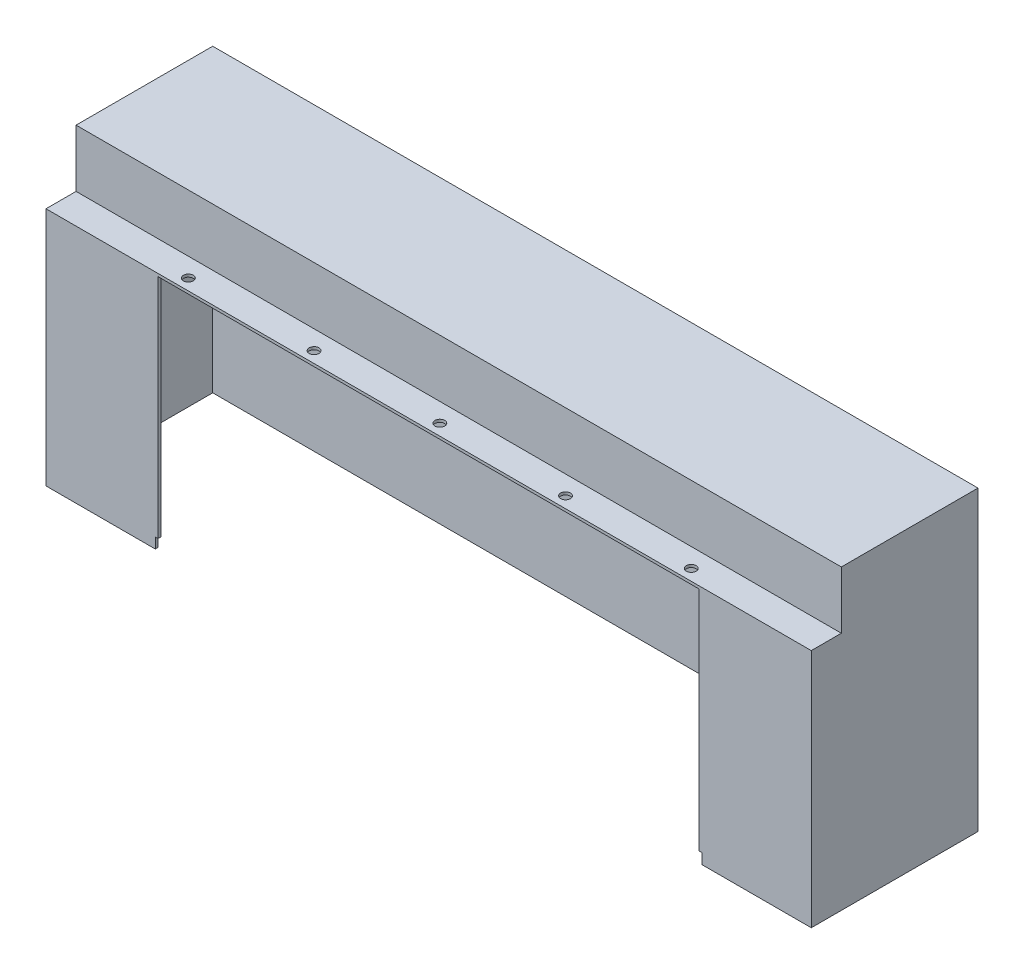
ISO-10303-21;
HEADER;
FILE_DESCRIPTION(('STEP AP214'),'2;1');
FILE_NAME('part.step','',(''),(''),'','','');
FILE_SCHEMA(('AUTOMOTIVE_DESIGN { 1 0 10303 214 1 1 1 1 }'));
ENDSEC;
DATA;
#1=APPLICATION_CONTEXT('core data for automotive mechanical design processes');
#2=APPLICATION_PROTOCOL_DEFINITION('international standard','automotive_design',2000,#1);
#3=PRODUCT_CONTEXT('',#1,'mechanical');
#4=PRODUCT('Part','Part','',(#3));
#5=PRODUCT_RELATED_PRODUCT_CATEGORY('part','',(#4));
#6=PRODUCT_DEFINITION_FORMATION('','',#4);
#7=PRODUCT_DEFINITION_CONTEXT('part definition',#1,'design');
#8=PRODUCT_DEFINITION('design','',#6,#7);
#9=PRODUCT_DEFINITION_SHAPE('','',#8);
#10=(LENGTH_UNIT() NAMED_UNIT(*) SI_UNIT(.MILLI.,.METRE.));
#11=(NAMED_UNIT(*) PLANE_ANGLE_UNIT() SI_UNIT($,.RADIAN.));
#12=(NAMED_UNIT(*) SI_UNIT($,.STERADIAN.) SOLID_ANGLE_UNIT());
#13=UNCERTAINTY_MEASURE_WITH_UNIT(LENGTH_MEASURE(1.E-05),#10,'distance_accuracy_value','');
#14=(GEOMETRIC_REPRESENTATION_CONTEXT(3) GLOBAL_UNCERTAINTY_ASSIGNED_CONTEXT((#13)) GLOBAL_UNIT_ASSIGNED_CONTEXT((#10,
#11,#12)) REPRESENTATION_CONTEXT('',''));
#15=CARTESIAN_POINT('',(0.,0.,0.));
#16=DIRECTION('',(0.,0.,1.));
#17=DIRECTION('',(1.,0.,0.));
#18=AXIS2_PLACEMENT_3D('',#15,#16,#17);
#19=CARTESIAN_POINT('',(350.,105.,2.5));
#20=DIRECTION('',(0.,-1.,0.));
#21=DIRECTION('',(1.,0.,0.));
#22=AXIS2_PLACEMENT_3D('',#19,#20,#21);
#23=PLANE('',#22);
#24=CARTESIAN_POINT('',(-230.,105.,142.29));
#25=DIRECTION('',(0.,1.,0.));
#26=DIRECTION('',(-1.,0.,0.));
#27=AXIS2_PLACEMENT_3D('',#24,#25,#26);
#28=CIRCLE('',#27,4.49999999999999);
#29=CARTESIAN_POINT('',(-234.5,105.,142.29));
#30=VERTEX_POINT('',#29);
#31=EDGE_CURVE('E250',#30,#30,#28,.T.);
#32=ORIENTED_EDGE('',*,*,#31,.F.);
#33=EDGE_LOOP('',(#32));
#34=FACE_BOUND('',#33,.T.);
#35=CARTESIAN_POINT('',(-115.,105.,142.29));
#36=DIRECTION('',(0.,1.,0.));
#37=DIRECTION('',(-1.,0.,0.));
#38=AXIS2_PLACEMENT_3D('',#35,#36,#37);
#39=CIRCLE('',#38,4.49999999999993);
#40=CARTESIAN_POINT('',(-119.5,105.,142.29));
#41=VERTEX_POINT('',#40);
#42=EDGE_CURVE('E244',#41,#41,#39,.T.);
#43=ORIENTED_EDGE('',*,*,#42,.F.);
#44=EDGE_LOOP('',(#43));
#45=FACE_BOUND('',#44,.T.);
#46=CARTESIAN_POINT('',(2.09554595897998E-13,105.,142.29));
#47=DIRECTION('',(0.,1.,0.));
#48=DIRECTION('',(-1.,0.,0.));
#49=AXIS2_PLACEMENT_3D('',#46,#47,#48);
#50=CIRCLE('',#49,4.49999999999994);
#51=CARTESIAN_POINT('',(-4.49999999999973,105.,142.29));
#52=VERTEX_POINT('',#51);
#53=EDGE_CURVE('E238',#52,#52,#50,.T.);
#54=ORIENTED_EDGE('',*,*,#53,.F.);
#55=EDGE_LOOP('',(#54));
#56=FACE_BOUND('',#55,.T.);
#57=CARTESIAN_POINT('',(115.,105.,142.29));
#58=DIRECTION('',(0.,1.,0.));
#59=DIRECTION('',(-1.,0.,0.));
#60=AXIS2_PLACEMENT_3D('',#57,#58,#59);
#61=CIRCLE('',#60,4.49999999999993);
#62=CARTESIAN_POINT('',(110.5,105.,142.29));
#63=VERTEX_POINT('',#62);
#64=EDGE_CURVE('E229',#63,#63,#61,.T.);
#65=ORIENTED_EDGE('',*,*,#64,.F.);
#66=EDGE_LOOP('',(#65));
#67=FACE_BOUND('',#66,.T.);
#68=CARTESIAN_POINT('',(230.,105.,142.29));
#69=DIRECTION('',(0.,1.,0.));
#70=DIRECTION('',(-1.,0.,0.));
#71=AXIS2_PLACEMENT_3D('',#68,#69,#70);
#72=CIRCLE('',#71,4.49999999999997);
#73=CARTESIAN_POINT('',(225.5,105.,142.29));
#74=VERTEX_POINT('',#73);
#75=EDGE_CURVE('E215',#74,#74,#72,.T.);
#76=ORIENTED_EDGE('',*,*,#75,.F.);
#77=EDGE_LOOP('',(#76));
#78=FACE_BOUND('',#77,.T.);
#79=DIRECTION('',(1.,0.,0.));
#80=VECTOR('',#79,1.);
#81=CARTESIAN_POINT('',(-350.,105.,125.));
#82=LINE('',#81,#80);
#83=CARTESIAN_POINT('',(-350.,105.,125.));
#84=VERTEX_POINT('',#83);
#85=CARTESIAN_POINT('',(350.,105.,125.));
#86=VERTEX_POINT('',#85);
#87=EDGE_CURVE('E52',#84,#86,#82,.T.);
#88=ORIENTED_EDGE('',*,*,#87,.F.);
#89=DIRECTION('',(0.,0.,-1.));
#90=VECTOR('',#89,1.);
#91=CARTESIAN_POINT('',(-350.,105.,2.5));
#92=LINE('',#91,#90);
#93=CARTESIAN_POINT('',(-350.,105.,152.5));
#94=VERTEX_POINT('',#93);
#95=EDGE_CURVE('E368',#94,#84,#92,.T.);
#96=ORIENTED_EDGE('',*,*,#95,.F.);
#97=DIRECTION('',(-1.,0.,0.));
#98=VECTOR('',#97,1.);
#99=CARTESIAN_POINT('',(350.,105.,152.5));
#100=LINE('',#99,#98);
#101=CARTESIAN_POINT('',(350.,105.,152.5));
#102=VERTEX_POINT('',#101);
#103=EDGE_CURVE('E341',#102,#94,#100,.T.);
#104=ORIENTED_EDGE('',*,*,#103,.F.);
#105=DIRECTION('',(0.,0.,-1.));
#106=VECTOR('',#105,1.);
#107=CARTESIAN_POINT('',(350.,105.,2.5));
#108=LINE('',#107,#106);
#109=EDGE_CURVE('E219',#102,#86,#108,.T.);
#110=ORIENTED_EDGE('',*,*,#109,.T.);
#111=EDGE_LOOP('',(#88,#96,#104,#110));
#112=FACE_BOUND('',#111,.T.);
#113=ADVANCED_FACE('F35',(#34,#45,#56,#67,#78,#112),#23,.F.);
#114=CARTESIAN_POINT('',(347.5,102.5,152.5));
#115=DIRECTION('',(0.,1.,0.));
#116=DIRECTION('',(-1.,0.,0.));
#117=AXIS2_PLACEMENT_3D('',#114,#115,#116);
#118=PLANE('',#117);
#119=CARTESIAN_POINT('',(230.,102.5,142.29));
#120=DIRECTION('',(0.,1.,0.));
#121=DIRECTION('',(-1.,0.,0.));
#122=AXIS2_PLACEMENT_3D('',#119,#120,#121);
#123=CIRCLE('',#122,4.49999999999997);
#124=CARTESIAN_POINT('',(225.5,102.5,142.29));
#125=VERTEX_POINT('',#124);
#126=EDGE_CURVE('E225',#125,#125,#123,.T.);
#127=ORIENTED_EDGE('',*,*,#126,.T.);
#128=EDGE_LOOP('',(#127));
#129=FACE_BOUND('',#128,.T.);
#130=CARTESIAN_POINT('',(115.,102.5,142.29));
#131=DIRECTION('',(0.,1.,0.));
#132=DIRECTION('',(-1.,0.,0.));
#133=AXIS2_PLACEMENT_3D('',#130,#131,#132);
#134=CIRCLE('',#133,4.49999999999993);
#135=CARTESIAN_POINT('',(110.5,102.5,142.29));
#136=VERTEX_POINT('',#135);
#137=EDGE_CURVE('E233',#136,#136,#134,.T.);
#138=ORIENTED_EDGE('',*,*,#137,.T.);
#139=EDGE_LOOP('',(#138));
#140=FACE_BOUND('',#139,.T.);
#141=CARTESIAN_POINT('',(2.09851977065309E-13,102.5,142.29));
#142=DIRECTION('',(0.,1.,0.));
#143=DIRECTION('',(-1.,0.,0.));
#144=AXIS2_PLACEMENT_3D('',#141,#142,#143);
#145=CIRCLE('',#144,4.49999999999994);
#146=CARTESIAN_POINT('',(-4.49999999999973,102.5,142.29));
#147=VERTEX_POINT('',#146);
#148=EDGE_CURVE('E241',#147,#147,#145,.T.);
#149=ORIENTED_EDGE('',*,*,#148,.T.);
#150=EDGE_LOOP('',(#149));
#151=FACE_BOUND('',#150,.T.);
#152=CARTESIAN_POINT('',(-115.,102.5,142.29));
#153=DIRECTION('',(0.,1.,0.));
#154=DIRECTION('',(-1.,0.,0.));
#155=AXIS2_PLACEMENT_3D('',#152,#153,#154);
#156=CIRCLE('',#155,4.49999999999993);
#157=CARTESIAN_POINT('',(-119.5,102.5,142.29));
#158=VERTEX_POINT('',#157);
#159=EDGE_CURVE('E247',#158,#158,#156,.T.);
#160=ORIENTED_EDGE('',*,*,#159,.T.);
#161=EDGE_LOOP('',(#160));
#162=FACE_BOUND('',#161,.T.);
#163=CARTESIAN_POINT('',(-230.,102.5,142.29));
#164=DIRECTION('',(0.,1.,0.));
#165=DIRECTION('',(-1.,0.,0.));
#166=AXIS2_PLACEMENT_3D('',#163,#164,#165);
#167=CIRCLE('',#166,4.49999999999999);
#168=CARTESIAN_POINT('',(-234.5,102.5,142.29));
#169=VERTEX_POINT('',#168);
#170=EDGE_CURVE('E253',#169,#169,#167,.T.);
#171=ORIENTED_EDGE('',*,*,#170,.T.);
#172=EDGE_LOOP('',(#171));
#173=FACE_BOUND('',#172,.T.);
#174=DIRECTION('',(0.,0.,-1.));
#175=VECTOR('',#174,1.);
#176=CARTESIAN_POINT('',(-247.5,102.5,152.5));
#177=LINE('',#176,#175);
#178=CARTESIAN_POINT('',(-247.5,102.5,152.5));
#179=VERTEX_POINT('',#178);
#180=CARTESIAN_POINT('',(-247.5,102.5,150.));
#181=VERTEX_POINT('',#180);
#182=EDGE_CURVE('E285',#179,#181,#177,.T.);
#183=ORIENTED_EDGE('',*,*,#182,.T.);
#184=DIRECTION('',(-1.,0.,0.));
#185=VECTOR('',#184,1.);
#186=CARTESIAN_POINT('',(-247.5,102.5,150.));
#187=LINE('',#186,#185);
#188=CARTESIAN_POINT('',(-347.5,102.5,150.));
#189=VERTEX_POINT('',#188);
#190=EDGE_CURVE('E288',#181,#189,#187,.T.);
#191=ORIENTED_EDGE('',*,*,#190,.T.);
#192=DIRECTION('',(0.,0.,-1.));
#193=VECTOR('',#192,1.);
#194=CARTESIAN_POINT('',(-347.5,102.5,152.5));
#195=LINE('',#194,#193);
#196=CARTESIAN_POINT('',(-347.5,102.5,122.5));
#197=VERTEX_POINT('',#196);
#198=EDGE_CURVE('E390',#189,#197,#195,.T.);
#199=ORIENTED_EDGE('',*,*,#198,.T.);
#200=DIRECTION('',(-1.,0.,0.));
#201=VECTOR('',#200,1.);
#202=CARTESIAN_POINT('',(-347.5,102.5,122.5));
#203=LINE('',#202,#201);
#204=CARTESIAN_POINT('',(347.5,102.5,122.5));
#205=VERTEX_POINT('',#204);
#206=EDGE_CURVE('E331',#205,#197,#203,.T.);
#207=ORIENTED_EDGE('',*,*,#206,.F.);
#208=DIRECTION('',(0.,0.,-1.));
#209=VECTOR('',#208,1.);
#210=CARTESIAN_POINT('',(347.5,102.5,152.5));
#211=LINE('',#210,#209);
#212=CARTESIAN_POINT('',(347.5,102.5,150.));
#213=VERTEX_POINT('',#212);
#214=EDGE_CURVE('E354',#213,#205,#211,.T.);
#215=ORIENTED_EDGE('',*,*,#214,.F.);
#216=DIRECTION('',(1.,0.,0.));
#217=VECTOR('',#216,1.);
#218=CARTESIAN_POINT('',(247.5,102.5,150.));
#219=LINE('',#218,#217);
#220=CARTESIAN_POINT('',(247.5,102.5,150.));
#221=VERTEX_POINT('',#220);
#222=EDGE_CURVE('E307',#221,#213,#219,.T.);
#223=ORIENTED_EDGE('',*,*,#222,.F.);
#224=DIRECTION('',(0.,0.,-1.));
#225=VECTOR('',#224,1.);
#226=CARTESIAN_POINT('',(247.5,102.5,152.5));
#227=LINE('',#226,#225);
#228=CARTESIAN_POINT('',(247.5,102.5,152.5));
#229=VERTEX_POINT('',#228);
#230=EDGE_CURVE('E298',#229,#221,#227,.T.);
#231=ORIENTED_EDGE('',*,*,#230,.F.);
#232=DIRECTION('',(1.,0.,0.));
#233=VECTOR('',#232,1.);
#234=CARTESIAN_POINT('',(347.5,102.5,152.5));
#235=LINE('',#234,#233);
#236=EDGE_CURVE('E348',#179,#229,#235,.T.);
#237=ORIENTED_EDGE('',*,*,#236,.F.);
#238=EDGE_LOOP('',(#183,#191,#199,#207,#215,#223,#231,#237));
#239=FACE_BOUND('',#238,.T.);
#240=ADVANCED_FACE('F399',(#129,#140,#151,#162,#173,#239),#118,.F.);
#241=CARTESIAN_POINT('',(347.5,102.5,152.5));
#242=DIRECTION('',(1.,0.,0.));
#243=DIRECTION('',(0.,0.,-1.));
#244=AXIS2_PLACEMENT_3D('',#241,#242,#243);
#245=PLANE('',#244);
#246=DIRECTION('',(0.,-1.,0.));
#247=VECTOR('',#246,1.);
#248=CARTESIAN_POINT('',(347.5,-114.58,150.));
#249=LINE('',#248,#247);
#250=CARTESIAN_POINT('',(347.5,-114.58,150.));
#251=VERTEX_POINT('',#250);
#252=EDGE_CURVE('E295',#213,#251,#249,.T.);
#253=ORIENTED_EDGE('',*,*,#252,.F.);
#254=ORIENTED_EDGE('',*,*,#214,.T.);
#255=DIRECTION('',(0.,1.,0.));
#256=VECTOR('',#255,1.);
#257=CARTESIAN_POINT('',(347.5,-105.00105,122.5));
#258=LINE('',#257,#256);
#259=CARTESIAN_POINT('',(347.5,155.,122.5));
#260=VERTEX_POINT('',#259);
#261=EDGE_CURVE('E334',#205,#260,#258,.T.);
#262=ORIENTED_EDGE('',*,*,#261,.T.);
#263=DIRECTION('',(0.,0.,-1.));
#264=VECTOR('',#263,1.);
#265=CARTESIAN_POINT('',(347.5,155.,122.5));
#266=LINE('',#265,#264);
#267=CARTESIAN_POINT('',(347.5,155.,2.5));
#268=VERTEX_POINT('',#267);
#269=EDGE_CURVE('E201',#260,#268,#266,.T.);
#270=ORIENTED_EDGE('',*,*,#269,.T.);
#271=DIRECTION('',(0.,-1.,0.));
#272=VECTOR('',#271,1.);
#273=CARTESIAN_POINT('',(347.5,102.5,2.5));
#274=LINE('',#273,#272);
#275=CARTESIAN_POINT('',(347.5,-114.58,2.5));
#276=VERTEX_POINT('',#275);
#277=EDGE_CURVE('E345',#268,#276,#274,.T.);
#278=ORIENTED_EDGE('',*,*,#277,.T.);
#279=DIRECTION('',(0.,0.,-1.));
#280=VECTOR('',#279,1.);
#281=CARTESIAN_POINT('',(347.5,-114.58,0.));
#282=LINE('',#281,#280);
#283=EDGE_CURVE('E321',#251,#276,#282,.T.);
#284=ORIENTED_EDGE('',*,*,#283,.F.);
#285=EDGE_LOOP('',(#253,#254,#262,#270,#278,#284));
#286=FACE_BOUND('',#285,.T.);
#287=ADVANCED_FACE('F396',(#286),#245,.F.);
#288=CARTESIAN_POINT('',(-350.,-105.,2.5));
#289=DIRECTION('',(1.,0.,0.));
#290=DIRECTION('',(0.,0.,-1.));
#291=AXIS2_PLACEMENT_3D('',#288,#289,#290);
#292=PLANE('',#291);
#293=DIRECTION('',(0.,-1.,0.));
#294=VECTOR('',#293,1.);
#295=CARTESIAN_POINT('',(-350.,-105.,0.));
#296=LINE('',#295,#294);
#297=CARTESIAN_POINT('',(-350.,157.5,0.));
#298=VERTEX_POINT('',#297);
#299=CARTESIAN_POINT('',(-350.,-114.58,0.));
#300=VERTEX_POINT('',#299);
#301=EDGE_CURVE('E392',#298,#300,#296,.T.);
#302=ORIENTED_EDGE('',*,*,#301,.T.);
#303=DIRECTION('',(0.,0.,-1.));
#304=VECTOR('',#303,1.);
#305=CARTESIAN_POINT('',(-350.,-114.58,0.));
#306=LINE('',#305,#304);
#307=CARTESIAN_POINT('',(-350.,-114.58,152.5));
#308=VERTEX_POINT('',#307);
#309=EDGE_CURVE('E309',#308,#300,#306,.T.);
#310=ORIENTED_EDGE('',*,*,#309,.F.);
#311=DIRECTION('',(0.,-1.,0.));
#312=VECTOR('',#311,1.);
#313=CARTESIAN_POINT('',(-350.,105.,152.5));
#314=LINE('',#313,#312);
#315=EDGE_CURVE('E344',#94,#308,#314,.T.);
#316=ORIENTED_EDGE('',*,*,#315,.F.);
#317=ORIENTED_EDGE('',*,*,#95,.T.);
#318=DIRECTION('',(0.,-1.,0.));
#319=VECTOR('',#318,1.);
#320=CARTESIAN_POINT('',(-350.,155.,125.));
#321=LINE('',#320,#319);
#322=CARTESIAN_POINT('',(-350.,157.5,125.));
#323=VERTEX_POINT('',#322);
#324=EDGE_CURVE('E181',#323,#84,#321,.T.);
#325=ORIENTED_EDGE('',*,*,#324,.F.);
#326=DIRECTION('',(0.,0.,1.));
#327=VECTOR('',#326,1.);
#328=CARTESIAN_POINT('',(-350.,157.5,0.));
#329=LINE('',#328,#327);
#330=EDGE_CURVE('E196',#298,#323,#329,.T.);
#331=ORIENTED_EDGE('',*,*,#330,.F.);
#332=EDGE_LOOP('',(#302,#310,#316,#317,#325,#331));
#333=FACE_BOUND('',#332,.T.);
#334=ADVANCED_FACE('F37',(#333),#292,.F.);
#335=CARTESIAN_POINT('',(350.,-105.,2.5));
#336=DIRECTION('',(-1.,0.,0.));
#337=DIRECTION('',(0.,0.,1.));
#338=AXIS2_PLACEMENT_3D('',#335,#336,#337);
#339=PLANE('',#338);
#340=DIRECTION('',(0.,1.,0.));
#341=VECTOR('',#340,1.);
#342=CARTESIAN_POINT('',(350.,-105.,0.));
#343=LINE('',#342,#341);
#344=CARTESIAN_POINT('',(350.,-114.58,0.));
#345=VERTEX_POINT('',#344);
#346=CARTESIAN_POINT('',(350.,157.5,0.));
#347=VERTEX_POINT('',#346);
#348=EDGE_CURVE('E187',#345,#347,#343,.T.);
#349=ORIENTED_EDGE('',*,*,#348,.T.);
#350=DIRECTION('',(0.,0.,-1.));
#351=VECTOR('',#350,1.);
#352=CARTESIAN_POINT('',(350.,157.5,125.));
#353=LINE('',#352,#351);
#354=CARTESIAN_POINT('',(350.,157.5,125.));
#355=VERTEX_POINT('',#354);
#356=EDGE_CURVE('E184',#355,#347,#353,.T.);
#357=ORIENTED_EDGE('',*,*,#356,.F.);
#358=DIRECTION('',(0.,-1.,0.));
#359=VECTOR('',#358,1.);
#360=CARTESIAN_POINT('',(350.,155.,125.));
#361=LINE('',#360,#359);
#362=EDGE_CURVE('E174',#355,#86,#361,.T.);
#363=ORIENTED_EDGE('',*,*,#362,.T.);
#364=ORIENTED_EDGE('',*,*,#109,.F.);
#365=DIRECTION('',(0.,1.,0.));
#366=VECTOR('',#365,1.);
#367=CARTESIAN_POINT('',(350.,-105.,152.5));
#368=LINE('',#367,#366);
#369=CARTESIAN_POINT('',(350.,-114.58,152.5));
#370=VERTEX_POINT('',#369);
#371=EDGE_CURVE('E351',#370,#102,#368,.T.);
#372=ORIENTED_EDGE('',*,*,#371,.F.);
#373=DIRECTION('',(0.,0.,1.));
#374=VECTOR('',#373,1.);
#375=CARTESIAN_POINT('',(350.,-114.58,0.));
#376=LINE('',#375,#374);
#377=EDGE_CURVE('E315',#345,#370,#376,.T.);
#378=ORIENTED_EDGE('',*,*,#377,.F.);
#379=EDGE_LOOP('',(#349,#357,#363,#364,#372,#378));
#380=FACE_BOUND('',#379,.T.);
#381=ADVANCED_FACE('F185',(#380),#339,.F.);
#382=CARTESIAN_POINT('',(0.,0.,2.5));
#383=DIRECTION('',(0.,0.,1.));
#384=DIRECTION('',(1.,0.,0.));
#385=AXIS2_PLACEMENT_3D('',#382,#383,#384);
#386=PLANE('',#385);
#387=ORIENTED_EDGE('',*,*,#277,.F.);
#388=DIRECTION('',(-1.,0.,0.));
#389=VECTOR('',#388,1.);
#390=CARTESIAN_POINT('',(-347.5,155.,2.5));
#391=LINE('',#390,#389);
#392=CARTESIAN_POINT('',(-347.5,155.,2.5));
#393=VERTEX_POINT('',#392);
#394=EDGE_CURVE('E204',#268,#393,#391,.T.);
#395=ORIENTED_EDGE('',*,*,#394,.T.);
#396=DIRECTION('',(0.,1.,0.));
#397=VECTOR('',#396,1.);
#398=CARTESIAN_POINT('',(-347.5,102.5,2.5));
#399=LINE('',#398,#397);
#400=CARTESIAN_POINT('',(-347.5,-114.58,2.5));
#401=VERTEX_POINT('',#400);
#402=EDGE_CURVE('E338',#401,#393,#399,.T.);
#403=ORIENTED_EDGE('',*,*,#402,.F.);
#404=DIRECTION('',(-1.,0.,0.));
#405=VECTOR('',#404,1.);
#406=CARTESIAN_POINT('',(0.,-114.58,2.5));
#407=LINE('',#406,#405);
#408=EDGE_CURVE('E323',#276,#401,#407,.T.);
#409=ORIENTED_EDGE('',*,*,#408,.F.);
#410=EDGE_LOOP('',(#387,#395,#403,#409));
#411=FACE_BOUND('',#410,.T.);
#412=ADVANCED_FACE('F383',(#411),#386,.T.);
#413=CARTESIAN_POINT('',(0.,0.,0.));
#414=DIRECTION('',(0.,0.,1.));
#415=DIRECTION('',(1.,0.,0.));
#416=AXIS2_PLACEMENT_3D('',#413,#414,#415);
#417=PLANE('',#416);
#418=ORIENTED_EDGE('',*,*,#301,.F.);
#419=DIRECTION('',(-1.,0.,0.));
#420=VECTOR('',#419,1.);
#421=CARTESIAN_POINT('',(350.,157.5,0.));
#422=LINE('',#421,#420);
#423=EDGE_CURVE('E191',#347,#298,#422,.T.);
#424=ORIENTED_EDGE('',*,*,#423,.F.);
#425=ORIENTED_EDGE('',*,*,#348,.F.);
#426=DIRECTION('',(1.,0.,0.));
#427=VECTOR('',#426,1.);
#428=CARTESIAN_POINT('',(0.,-114.58,0.));
#429=LINE('',#428,#427);
#430=EDGE_CURVE('E312',#300,#345,#429,.T.);
#431=ORIENTED_EDGE('',*,*,#430,.F.);
#432=EDGE_LOOP('',(#418,#424,#425,#431));
#433=FACE_BOUND('',#432,.T.);
#434=ADVANCED_FACE('F417',(#433),#417,.F.);
#435=CARTESIAN_POINT('',(-347.5,102.5,152.5));
#436=DIRECTION('',(-1.,0.,0.));
#437=DIRECTION('',(0.,0.,1.));
#438=AXIS2_PLACEMENT_3D('',#435,#436,#437);
#439=PLANE('',#438);
#440=ORIENTED_EDGE('',*,*,#198,.F.);
#441=DIRECTION('',(0.,-1.,0.));
#442=VECTOR('',#441,1.);
#443=CARTESIAN_POINT('',(-347.5,-114.58,150.));
#444=LINE('',#443,#442);
#445=CARTESIAN_POINT('',(-347.5,-114.58,150.));
#446=VERTEX_POINT('',#445);
#447=EDGE_CURVE('E279',#189,#446,#444,.T.);
#448=ORIENTED_EDGE('',*,*,#447,.T.);
#449=DIRECTION('',(0.,0.,1.));
#450=VECTOR('',#449,1.);
#451=CARTESIAN_POINT('',(-347.5,-114.58,0.));
#452=LINE('',#451,#450);
#453=EDGE_CURVE('E326',#401,#446,#452,.T.);
#454=ORIENTED_EDGE('',*,*,#453,.F.);
#455=ORIENTED_EDGE('',*,*,#402,.T.);
#456=DIRECTION('',(0.,0.,1.));
#457=VECTOR('',#456,1.);
#458=CARTESIAN_POINT('',(-347.5,155.,122.5));
#459=LINE('',#458,#457);
#460=CARTESIAN_POINT('',(-347.5,155.,122.5));
#461=VERTEX_POINT('',#460);
#462=EDGE_CURVE('E207',#393,#461,#459,.T.);
#463=ORIENTED_EDGE('',*,*,#462,.T.);
#464=DIRECTION('',(0.,1.,0.));
#465=VECTOR('',#464,1.);
#466=CARTESIAN_POINT('',(-347.5,-105.00105,122.5));
#467=LINE('',#466,#465);
#468=EDGE_CURVE('E335',#197,#461,#467,.T.);
#469=ORIENTED_EDGE('',*,*,#468,.F.);
#470=EDGE_LOOP('',(#440,#448,#454,#455,#463,#469));
#471=FACE_BOUND('',#470,.T.);
#472=ADVANCED_FACE('F378',(#471),#439,.F.);
#473=CARTESIAN_POINT('',(0.,0.,152.5));
#474=DIRECTION('',(0.,0.,1.));
#475=DIRECTION('',(1.,0.,0.));
#476=AXIS2_PLACEMENT_3D('',#473,#474,#475);
#477=PLANE('',#476);
#478=DIRECTION('',(-1.,0.,0.));
#479=VECTOR('',#478,1.);
#480=CARTESIAN_POINT('',(247.5,-104.98,152.5));
#481=LINE('',#480,#479);
#482=CARTESIAN_POINT('',(250.,-104.98,152.5));
#483=VERTEX_POINT('',#482);
#484=CARTESIAN_POINT('',(247.5,-104.98,152.5));
#485=VERTEX_POINT('',#484);
#486=EDGE_CURVE('E60',#483,#485,#481,.T.);
#487=ORIENTED_EDGE('',*,*,#486,.F.);
#488=DIRECTION('',(0.,1.,0.));
#489=VECTOR('',#488,1.);
#490=CARTESIAN_POINT('',(250.,-114.58,152.5));
#491=LINE('',#490,#489);
#492=CARTESIAN_POINT('',(250.,-114.58,152.5));
#493=VERTEX_POINT('',#492);
#494=EDGE_CURVE('E256',#493,#483,#491,.T.);
#495=ORIENTED_EDGE('',*,*,#494,.F.);
#496=DIRECTION('',(-1.,0.,0.));
#497=VECTOR('',#496,1.);
#498=CARTESIAN_POINT('',(0.,-114.58,152.5));
#499=LINE('',#498,#497);
#500=EDGE_CURVE('E318',#370,#493,#499,.T.);
#501=ORIENTED_EDGE('',*,*,#500,.F.);
#502=ORIENTED_EDGE('',*,*,#371,.T.);
#503=ORIENTED_EDGE('',*,*,#103,.T.);
#504=ORIENTED_EDGE('',*,*,#315,.T.);
#505=DIRECTION('',(-1.,0.,0.));
#506=VECTOR('',#505,1.);
#507=CARTESIAN_POINT('',(0.,-114.58,152.5));
#508=LINE('',#507,#506);
#509=CARTESIAN_POINT('',(-250.,-114.58,152.5));
#510=VERTEX_POINT('',#509);
#511=EDGE_CURVE('E329',#510,#308,#508,.T.);
#512=ORIENTED_EDGE('',*,*,#511,.F.);
#513=DIRECTION('',(0.,-1.,0.));
#514=VECTOR('',#513,1.);
#515=CARTESIAN_POINT('',(-250.,-114.58,152.5));
#516=LINE('',#515,#514);
#517=CARTESIAN_POINT('',(-250.,-104.98,152.5));
#518=VERTEX_POINT('',#517);
#519=EDGE_CURVE('E270',#518,#510,#516,.T.);
#520=ORIENTED_EDGE('',*,*,#519,.F.);
#521=DIRECTION('',(-1.,0.,0.));
#522=VECTOR('',#521,1.);
#523=CARTESIAN_POINT('',(-247.5,-104.98,152.5));
#524=LINE('',#523,#522);
#525=CARTESIAN_POINT('',(-247.5,-104.98,152.5));
#526=VERTEX_POINT('',#525);
#527=EDGE_CURVE('E267',#526,#518,#524,.T.);
#528=ORIENTED_EDGE('',*,*,#527,.F.);
#529=DIRECTION('',(0.,1.,0.));
#530=VECTOR('',#529,1.);
#531=CARTESIAN_POINT('',(-247.5,-114.58,152.5));
#532=LINE('',#531,#530);
#533=EDGE_CURVE('E280',#526,#179,#532,.T.);
#534=ORIENTED_EDGE('',*,*,#533,.T.);
#535=ORIENTED_EDGE('',*,*,#236,.T.);
#536=DIRECTION('',(0.,1.,0.));
#537=VECTOR('',#536,1.);
#538=CARTESIAN_POINT('',(247.5,-114.58,152.5));
#539=LINE('',#538,#537);
#540=EDGE_CURVE('E296',#485,#229,#539,.T.);
#541=ORIENTED_EDGE('',*,*,#540,.F.);
#542=EDGE_LOOP('',(#487,#495,#501,#502,#503,#504,#512,#520,#528,#534,#535,#541));
#543=FACE_BOUND('',#542,.T.);
#544=ADVANCED_FACE('F416',(#543),#477,.T.);
#545=CARTESIAN_POINT('',(-347.5,-105.00105,122.5));
#546=DIRECTION('',(0.,0.,1.));
#547=DIRECTION('',(1.,0.,0.));
#548=AXIS2_PLACEMENT_3D('',#545,#546,#547);
#549=PLANE('',#548);
#550=ORIENTED_EDGE('',*,*,#206,.T.);
#551=ORIENTED_EDGE('',*,*,#468,.T.);
#552=DIRECTION('',(1.,0.,0.));
#553=VECTOR('',#552,1.);
#554=CARTESIAN_POINT('',(-347.5,155.,122.5));
#555=LINE('',#554,#553);
#556=EDGE_CURVE('E210',#461,#260,#555,.T.);
#557=ORIENTED_EDGE('',*,*,#556,.T.);
#558=ORIENTED_EDGE('',*,*,#261,.F.);
#559=EDGE_LOOP('',(#550,#551,#557,#558));
#560=FACE_BOUND('',#559,.T.);
#561=ADVANCED_FACE('F388',(#560),#549,.F.);
#562=CARTESIAN_POINT('',(0.,-114.58,0.));
#563=DIRECTION('',(0.,-1.,0.));
#564=DIRECTION('',(1.,0.,0.));
#565=AXIS2_PLACEMENT_3D('',#562,#563,#564);
#566=PLANE('',#565);
#567=DIRECTION('',(0.,0.,1.));
#568=VECTOR('',#567,1.);
#569=CARTESIAN_POINT('',(250.,-114.58,143.));
#570=LINE('',#569,#568);
#571=CARTESIAN_POINT('',(250.,-114.58,150.));
#572=VERTEX_POINT('',#571);
#573=EDGE_CURVE('E260',#572,#493,#570,.T.);
#574=ORIENTED_EDGE('',*,*,#573,.F.);
#575=DIRECTION('',(1.,0.,0.));
#576=VECTOR('',#575,1.);
#577=CARTESIAN_POINT('',(247.5,-114.58,150.));
#578=LINE('',#577,#576);
#579=EDGE_CURVE('E303',#572,#251,#578,.T.);
#580=ORIENTED_EDGE('',*,*,#579,.T.);
#581=ORIENTED_EDGE('',*,*,#283,.T.);
#582=ORIENTED_EDGE('',*,*,#408,.T.);
#583=ORIENTED_EDGE('',*,*,#453,.T.);
#584=DIRECTION('',(-1.,0.,0.));
#585=VECTOR('',#584,1.);
#586=CARTESIAN_POINT('',(-247.5,-114.58,150.));
#587=LINE('',#586,#585);
#588=CARTESIAN_POINT('',(-250.,-114.58,150.));
#589=VERTEX_POINT('',#588);
#590=EDGE_CURVE('E293',#589,#446,#587,.T.);
#591=ORIENTED_EDGE('',*,*,#590,.F.);
#592=DIRECTION('',(0.,0.,1.));
#593=VECTOR('',#592,1.);
#594=CARTESIAN_POINT('',(-250.,-114.58,143.));
#595=LINE('',#594,#593);
#596=EDGE_CURVE('E273',#589,#510,#595,.T.);
#597=ORIENTED_EDGE('',*,*,#596,.T.);
#598=ORIENTED_EDGE('',*,*,#511,.T.);
#599=ORIENTED_EDGE('',*,*,#309,.T.);
#600=ORIENTED_EDGE('',*,*,#430,.T.);
#601=ORIENTED_EDGE('',*,*,#377,.T.);
#602=ORIENTED_EDGE('',*,*,#500,.T.);
#603=EDGE_LOOP('',(#574,#580,#581,#582,#583,#591,#597,#598,#599,#600,#601,#602));
#604=FACE_BOUND('',#603,.T.);
#605=ADVANCED_FACE('F434',(#604),#566,.T.);
#606=CARTESIAN_POINT('',(247.5,-114.58,150.));
#607=DIRECTION('',(0.,0.,1.));
#608=DIRECTION('',(1.,0.,0.));
#609=AXIS2_PLACEMENT_3D('',#606,#607,#608);
#610=PLANE('',#609);
#611=DIRECTION('',(0.,1.,0.));
#612=VECTOR('',#611,1.);
#613=CARTESIAN_POINT('',(250.,-114.58,150.));
#614=LINE('',#613,#612);
#615=CARTESIAN_POINT('',(250.,-104.98,150.));
#616=VERTEX_POINT('',#615);
#617=EDGE_CURVE('E11',#572,#616,#614,.T.);
#618=ORIENTED_EDGE('',*,*,#617,.T.);
#619=DIRECTION('',(-1.,0.,0.));
#620=VECTOR('',#619,1.);
#621=CARTESIAN_POINT('',(247.5,-104.98,150.));
#622=LINE('',#621,#620);
#623=CARTESIAN_POINT('',(247.5,-104.98,150.));
#624=VERTEX_POINT('',#623);
#625=EDGE_CURVE('E263',#616,#624,#622,.T.);
#626=ORIENTED_EDGE('',*,*,#625,.T.);
#627=DIRECTION('',(0.,-1.,0.));
#628=VECTOR('',#627,1.);
#629=CARTESIAN_POINT('',(247.5,-114.58,150.));
#630=LINE('',#629,#628);
#631=EDGE_CURVE('E300',#221,#624,#630,.T.);
#632=ORIENTED_EDGE('',*,*,#631,.F.);
#633=ORIENTED_EDGE('',*,*,#222,.T.);
#634=ORIENTED_EDGE('',*,*,#252,.T.);
#635=ORIENTED_EDGE('',*,*,#579,.F.);
#636=EDGE_LOOP('',(#618,#626,#632,#633,#634,#635));
#637=FACE_BOUND('',#636,.T.);
#638=ADVANCED_FACE('F445',(#637),#610,.F.);
#639=CARTESIAN_POINT('',(247.5,0.,0.));
#640=DIRECTION('',(-1.,0.,0.));
#641=DIRECTION('',(0.,0.,1.));
#642=AXIS2_PLACEMENT_3D('',#639,#640,#641);
#643=PLANE('',#642);
#644=DIRECTION('',(0.,0.,-1.));
#645=VECTOR('',#644,1.);
#646=CARTESIAN_POINT('',(247.5,-104.98,0.));
#647=LINE('',#646,#645);
#648=EDGE_CURVE('E44',#485,#624,#647,.T.);
#649=ORIENTED_EDGE('',*,*,#648,.F.);
#650=ORIENTED_EDGE('',*,*,#540,.T.);
#651=ORIENTED_EDGE('',*,*,#230,.T.);
#652=ORIENTED_EDGE('',*,*,#631,.T.);
#653=EDGE_LOOP('',(#649,#650,#651,#652));
#654=FACE_BOUND('',#653,.T.);
#655=ADVANCED_FACE('F465',(#654),#643,.T.);
#656=CARTESIAN_POINT('',(-247.5,-114.58,150.));
#657=DIRECTION('',(0.,0.,-1.));
#658=DIRECTION('',(-1.,0.,0.));
#659=AXIS2_PLACEMENT_3D('',#656,#657,#658);
#660=PLANE('',#659);
#661=DIRECTION('',(0.,1.,0.));
#662=VECTOR('',#661,1.);
#663=CARTESIAN_POINT('',(-250.,-114.58,150.));
#664=LINE('',#663,#662);
#665=CARTESIAN_POINT('',(-250.,-104.98,150.));
#666=VERTEX_POINT('',#665);
#667=EDGE_CURVE('E366',#589,#666,#664,.T.);
#668=ORIENTED_EDGE('',*,*,#667,.F.);
#669=ORIENTED_EDGE('',*,*,#590,.T.);
#670=ORIENTED_EDGE('',*,*,#447,.F.);
#671=ORIENTED_EDGE('',*,*,#190,.F.);
#672=DIRECTION('',(0.,-1.,0.));
#673=VECTOR('',#672,1.);
#674=CARTESIAN_POINT('',(-247.5,-114.58,150.));
#675=LINE('',#674,#673);
#676=CARTESIAN_POINT('',(-247.5,-104.98,150.));
#677=VERTEX_POINT('',#676);
#678=EDGE_CURVE('E282',#181,#677,#675,.T.);
#679=ORIENTED_EDGE('',*,*,#678,.T.);
#680=DIRECTION('',(1.,0.,0.));
#681=VECTOR('',#680,1.);
#682=CARTESIAN_POINT('',(-247.5,-104.98,150.));
#683=LINE('',#682,#681);
#684=EDGE_CURVE('E276',#666,#677,#683,.T.);
#685=ORIENTED_EDGE('',*,*,#684,.F.);
#686=EDGE_LOOP('',(#668,#669,#670,#671,#679,#685));
#687=FACE_BOUND('',#686,.T.);
#688=ADVANCED_FACE('F449',(#687),#660,.T.);
#689=CARTESIAN_POINT('',(-247.5,0.,0.));
#690=DIRECTION('',(1.,0.,0.));
#691=DIRECTION('',(0.,0.,1.));
#692=AXIS2_PLACEMENT_3D('',#689,#690,#691);
#693=PLANE('',#692);
#694=DIRECTION('',(0.,0.,1.));
#695=VECTOR('',#694,1.);
#696=CARTESIAN_POINT('',(-247.5,-104.98,0.));
#697=LINE('',#696,#695);
#698=EDGE_CURVE('E364',#677,#526,#697,.T.);
#699=ORIENTED_EDGE('',*,*,#698,.F.);
#700=ORIENTED_EDGE('',*,*,#678,.F.);
#701=ORIENTED_EDGE('',*,*,#182,.F.);
#702=ORIENTED_EDGE('',*,*,#533,.F.);
#703=EDGE_LOOP('',(#699,#700,#701,#702));
#704=FACE_BOUND('',#703,.T.);
#705=ADVANCED_FACE('F460',(#704),#693,.T.);
#706=CARTESIAN_POINT('',(-250.,-114.58,143.));
#707=DIRECTION('',(-1.,0.,0.));
#708=DIRECTION('',(0.,0.,1.));
#709=AXIS2_PLACEMENT_3D('',#706,#707,#708);
#710=PLANE('',#709);
#711=ORIENTED_EDGE('',*,*,#667,.T.);
#712=DIRECTION('',(0.,0.,1.));
#713=VECTOR('',#712,1.);
#714=CARTESIAN_POINT('',(-250.,-104.98,143.));
#715=LINE('',#714,#713);
#716=EDGE_CURVE('E272',#666,#518,#715,.T.);
#717=ORIENTED_EDGE('',*,*,#716,.T.);
#718=ORIENTED_EDGE('',*,*,#519,.T.);
#719=ORIENTED_EDGE('',*,*,#596,.F.);
#720=EDGE_LOOP('',(#711,#717,#718,#719));
#721=FACE_BOUND('',#720,.T.);
#722=ADVANCED_FACE('F453',(#721),#710,.F.);
#723=CARTESIAN_POINT('',(-247.5,-104.98,143.));
#724=DIRECTION('',(0.,1.,0.));
#725=DIRECTION('',(0.,0.,1.));
#726=AXIS2_PLACEMENT_3D('',#723,#724,#725);
#727=PLANE('',#726);
#728=ORIENTED_EDGE('',*,*,#684,.T.);
#729=ORIENTED_EDGE('',*,*,#698,.T.);
#730=ORIENTED_EDGE('',*,*,#527,.T.);
#731=ORIENTED_EDGE('',*,*,#716,.F.);
#732=EDGE_LOOP('',(#728,#729,#730,#731));
#733=FACE_BOUND('',#732,.T.);
#734=ADVANCED_FACE('F455',(#733),#727,.F.);
#735=CARTESIAN_POINT('',(250.,-114.58,143.));
#736=DIRECTION('',(1.,0.,0.));
#737=DIRECTION('',(0.,0.,-1.));
#738=AXIS2_PLACEMENT_3D('',#735,#736,#737);
#739=PLANE('',#738);
#740=ORIENTED_EDGE('',*,*,#573,.T.);
#741=ORIENTED_EDGE('',*,*,#494,.T.);
#742=DIRECTION('',(0.,0.,1.));
#743=VECTOR('',#742,1.);
#744=CARTESIAN_POINT('',(250.,-104.98,143.));
#745=LINE('',#744,#743);
#746=EDGE_CURVE('E261',#616,#483,#745,.T.);
#747=ORIENTED_EDGE('',*,*,#746,.F.);
#748=ORIENTED_EDGE('',*,*,#617,.F.);
#749=EDGE_LOOP('',(#740,#741,#747,#748));
#750=FACE_BOUND('',#749,.T.);
#751=ADVANCED_FACE('F468',(#750),#739,.F.);
#752=CARTESIAN_POINT('',(247.5,-104.98,143.));
#753=DIRECTION('',(0.,1.,0.));
#754=DIRECTION('',(0.,0.,1.));
#755=AXIS2_PLACEMENT_3D('',#752,#753,#754);
#756=PLANE('',#755);
#757=ORIENTED_EDGE('',*,*,#746,.T.);
#758=ORIENTED_EDGE('',*,*,#486,.T.);
#759=ORIENTED_EDGE('',*,*,#648,.T.);
#760=ORIENTED_EDGE('',*,*,#625,.F.);
#761=EDGE_LOOP('',(#757,#758,#759,#760));
#762=FACE_BOUND('',#761,.T.);
#763=ADVANCED_FACE('F466',(#762),#756,.F.);
#764=CARTESIAN_POINT('',(-230.,102.,142.29));
#765=DIRECTION('',(0.,1.,0.));
#766=DIRECTION('',(-1.,0.,0.));
#767=AXIS2_PLACEMENT_3D('',#764,#765,#766);
#768=CYLINDRICAL_SURFACE('',#767,4.49999999999999);
#769=ORIENTED_EDGE('',*,*,#31,.T.);
#770=EDGE_LOOP('',(#769));
#771=FACE_BOUND('',#770,.T.);
#772=ORIENTED_EDGE('',*,*,#170,.F.);
#773=EDGE_LOOP('',(#772));
#774=FACE_BOUND('',#773,.T.);
#775=ADVANCED_FACE('F475',(#771,#774),#768,.F.);
#776=CARTESIAN_POINT('',(-115.,102.,142.29));
#777=DIRECTION('',(0.,1.,0.));
#778=DIRECTION('',(-1.,0.,0.));
#779=AXIS2_PLACEMENT_3D('',#776,#777,#778);
#780=CYLINDRICAL_SURFACE('',#779,4.49999999999993);
#781=ORIENTED_EDGE('',*,*,#42,.T.);
#782=EDGE_LOOP('',(#781));
#783=FACE_BOUND('',#782,.T.);
#784=ORIENTED_EDGE('',*,*,#159,.F.);
#785=EDGE_LOOP('',(#784));
#786=FACE_BOUND('',#785,.T.);
#787=ADVANCED_FACE('F556',(#783,#786),#780,.F.);
#788=CARTESIAN_POINT('',(2.09911453298771E-13,102.,142.29));
#789=DIRECTION('',(0.,1.,0.));
#790=DIRECTION('',(-1.,0.,0.));
#791=AXIS2_PLACEMENT_3D('',#788,#789,#790);
#792=CYLINDRICAL_SURFACE('',#791,4.49999999999994);
#793=ORIENTED_EDGE('',*,*,#53,.T.);
#794=EDGE_LOOP('',(#793));
#795=FACE_BOUND('',#794,.T.);
#796=ORIENTED_EDGE('',*,*,#148,.F.);
#797=EDGE_LOOP('',(#796));
#798=FACE_BOUND('',#797,.T.);
#799=ADVANCED_FACE('F565',(#795,#798),#792,.F.);
#800=CARTESIAN_POINT('',(115.,102.,142.29));
#801=DIRECTION('',(0.,1.,0.));
#802=DIRECTION('',(-1.,0.,0.));
#803=AXIS2_PLACEMENT_3D('',#800,#801,#802);
#804=CYLINDRICAL_SURFACE('',#803,4.49999999999993);
#805=ORIENTED_EDGE('',*,*,#64,.T.);
#806=EDGE_LOOP('',(#805));
#807=FACE_BOUND('',#806,.T.);
#808=ORIENTED_EDGE('',*,*,#137,.F.);
#809=EDGE_LOOP('',(#808));
#810=FACE_BOUND('',#809,.T.);
#811=ADVANCED_FACE('F575',(#807,#810),#804,.F.);
#812=CARTESIAN_POINT('',(230.,102.,142.29));
#813=DIRECTION('',(0.,1.,0.));
#814=DIRECTION('',(-1.,0.,0.));
#815=AXIS2_PLACEMENT_3D('',#812,#813,#814);
#816=CYLINDRICAL_SURFACE('',#815,4.49999999999997);
#817=ORIENTED_EDGE('',*,*,#75,.T.);
#818=EDGE_LOOP('',(#817));
#819=FACE_BOUND('',#818,.T.);
#820=ORIENTED_EDGE('',*,*,#126,.F.);
#821=EDGE_LOOP('',(#820));
#822=FACE_BOUND('',#821,.T.);
#823=ADVANCED_FACE('F585',(#819,#822),#816,.F.);
#824=CARTESIAN_POINT('',(-350.,155.,125.));
#825=DIRECTION('',(0.,0.,-1.));
#826=DIRECTION('',(-1.,0.,0.));
#827=AXIS2_PLACEMENT_3D('',#824,#825,#826);
#828=PLANE('',#827);
#829=ORIENTED_EDGE('',*,*,#87,.T.);
#830=ORIENTED_EDGE('',*,*,#362,.F.);
#831=DIRECTION('',(1.,0.,0.));
#832=VECTOR('',#831,1.);
#833=CARTESIAN_POINT('',(-350.,157.5,125.));
#834=LINE('',#833,#832);
#835=EDGE_CURVE('E179',#323,#355,#834,.T.);
#836=ORIENTED_EDGE('',*,*,#835,.F.);
#837=ORIENTED_EDGE('',*,*,#324,.T.);
#838=EDGE_LOOP('',(#829,#830,#836,#837));
#839=FACE_BOUND('',#838,.T.);
#840=ADVANCED_FACE('F176',(#839),#828,.F.);
#841=CARTESIAN_POINT('',(0.,157.5,0.));
#842=DIRECTION('',(0.,1.,0.));
#843=DIRECTION('',(-1.,0.,0.));
#844=AXIS2_PLACEMENT_3D('',#841,#842,#843);
#845=PLANE('',#844);
#846=ORIENTED_EDGE('',*,*,#835,.T.);
#847=ORIENTED_EDGE('',*,*,#356,.T.);
#848=ORIENTED_EDGE('',*,*,#423,.T.);
#849=ORIENTED_EDGE('',*,*,#330,.T.);
#850=EDGE_LOOP('',(#846,#847,#848,#849));
#851=FACE_BOUND('',#850,.T.);
#852=ADVANCED_FACE('F194',(#851),#845,.T.);
#853=CARTESIAN_POINT('',(0.,155.,0.));
#854=DIRECTION('',(0.,1.,0.));
#855=DIRECTION('',(-1.,0.,0.));
#856=AXIS2_PLACEMENT_3D('',#853,#854,#855);
#857=PLANE('',#856);
#858=ORIENTED_EDGE('',*,*,#394,.F.);
#859=ORIENTED_EDGE('',*,*,#269,.F.);
#860=ORIENTED_EDGE('',*,*,#556,.F.);
#861=ORIENTED_EDGE('',*,*,#462,.F.);
#862=EDGE_LOOP('',(#858,#859,#860,#861));
#863=FACE_BOUND('',#862,.T.);
#864=ADVANCED_FACE('F385',(#863),#857,.F.);
#865=CLOSED_SHELL('',(#113,#240,#287,#334,#381,#412,#434,#472,#544,#561,#605,#638,#655,#688,
#705,#722,#734,#751,#763,#775,#787,#799,#811,#823,#840,#852,#864));
#866=MANIFOLD_SOLID_BREP('B2',#865);
#867=ADVANCED_BREP_SHAPE_REPRESENTATION('',(#18,#866),#14);
#868=SHAPE_DEFINITION_REPRESENTATION(#9,#867);
ENDSEC;
END-ISO-10303-21;
